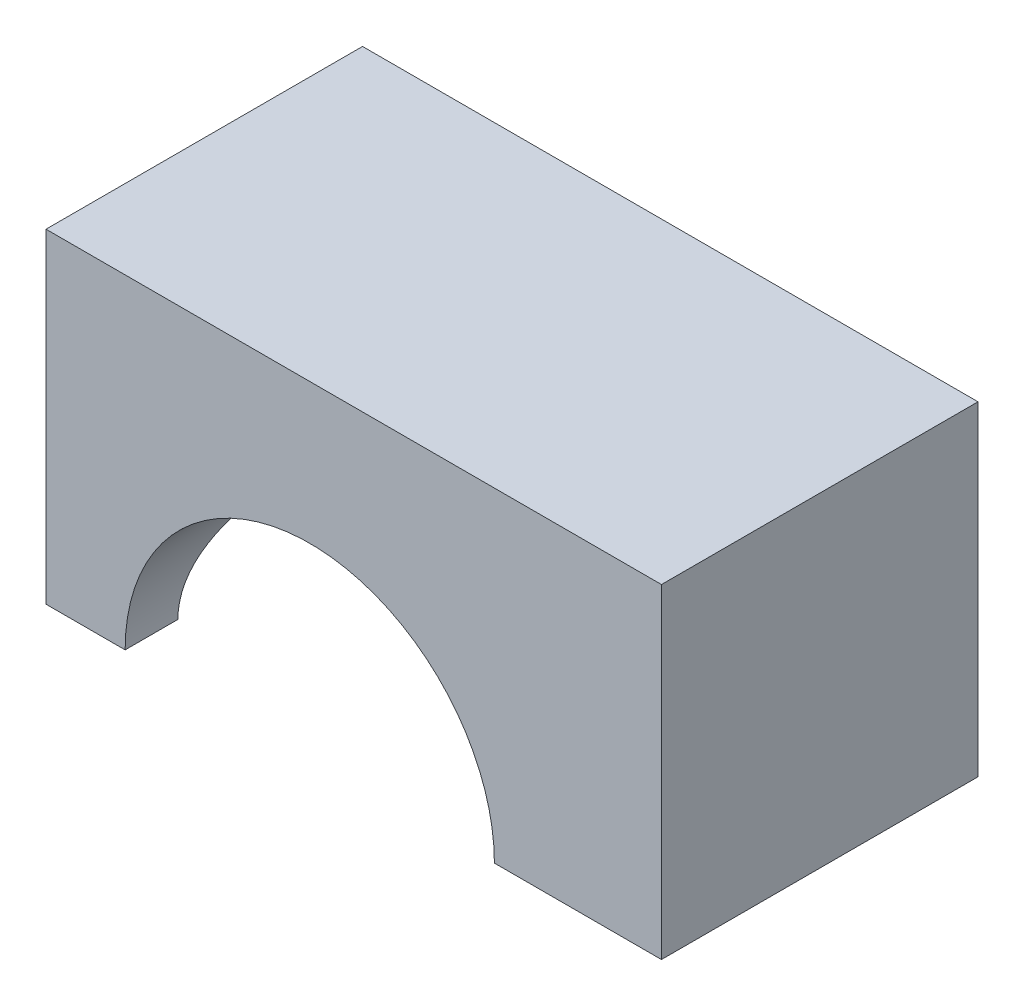
ISO-10303-21;
HEADER;
FILE_DESCRIPTION(('STEP AP214'),'2;1');
FILE_NAME('part.step','',(''),(''),'','','');
FILE_SCHEMA(('AUTOMOTIVE_DESIGN { 1 0 10303 214 1 1 1 1 }'));
ENDSEC;
DATA;
#1=APPLICATION_CONTEXT('core data for automotive mechanical design processes');
#2=APPLICATION_PROTOCOL_DEFINITION('international standard','automotive_design',2000,#1);
#3=PRODUCT_CONTEXT('',#1,'mechanical');
#4=PRODUCT('Part','Part','',(#3));
#5=PRODUCT_RELATED_PRODUCT_CATEGORY('part','',(#4));
#6=PRODUCT_DEFINITION_FORMATION('','',#4);
#7=PRODUCT_DEFINITION_CONTEXT('part definition',#1,'design');
#8=PRODUCT_DEFINITION('design','',#6,#7);
#9=PRODUCT_DEFINITION_SHAPE('','',#8);
#10=(LENGTH_UNIT() NAMED_UNIT(*) SI_UNIT(.MILLI.,.METRE.));
#11=(NAMED_UNIT(*) PLANE_ANGLE_UNIT() SI_UNIT($,.RADIAN.));
#12=(NAMED_UNIT(*) SI_UNIT($,.STERADIAN.) SOLID_ANGLE_UNIT());
#13=UNCERTAINTY_MEASURE_WITH_UNIT(LENGTH_MEASURE(1.E-05),#10,'distance_accuracy_value','');
#14=(GEOMETRIC_REPRESENTATION_CONTEXT(3) GLOBAL_UNCERTAINTY_ASSIGNED_CONTEXT((#13)) GLOBAL_UNIT_ASSIGNED_CONTEXT((#10,
#11,#12)) REPRESENTATION_CONTEXT('',''));
#15=CARTESIAN_POINT('',(0.,0.,0.));
#16=DIRECTION('',(0.,0.,1.));
#17=DIRECTION('',(1.,0.,0.));
#18=AXIS2_PLACEMENT_3D('',#15,#16,#17);
#19=CARTESIAN_POINT('',(0.,0.,0.));
#20=DIRECTION('',(0.,-1.,0.));
#21=DIRECTION('',(0.,0.,-1.));
#22=AXIS2_PLACEMENT_3D('',#19,#20,#21);
#23=PLANE('',#22);
#24=DIRECTION('',(0.,0.,1.));
#25=VECTOR('',#24,1.);
#26=CARTESIAN_POINT('',(-15.,0.,9.));
#27=LINE('',#26,#25);
#28=CARTESIAN_POINT('',(-15.,0.,6.));
#29=VERTEX_POINT('',#28);
#30=CARTESIAN_POINT('',(-15.,0.,9.));
#31=VERTEX_POINT('',#30);
#32=EDGE_CURVE('E111',#29,#31,#27,.T.);
#33=ORIENTED_EDGE('',*,*,#32,.F.);
#34=DIRECTION('',(-1.,0.,0.));
#35=VECTOR('',#34,1.);
#36=CARTESIAN_POINT('',(20.001,0.,6.));
#37=LINE('',#36,#35);
#38=CARTESIAN_POINT('',(-10.5,0.,6.));
#39=VERTEX_POINT('',#38);
#40=EDGE_CURVE('E157',#29,#39,#37,.F.);
#41=ORIENTED_EDGE('',*,*,#40,.T.);
#42=DIRECTION('',(0.,0.,1.));
#43=VECTOR('',#42,1.);
#44=CARTESIAN_POINT('',(-10.5,0.,-9.001));
#45=LINE('',#44,#43);
#46=CARTESIAN_POINT('',(-10.5,0.,9.));
#47=VERTEX_POINT('',#46);
#48=EDGE_CURVE('E149',#39,#47,#45,.T.);
#49=ORIENTED_EDGE('',*,*,#48,.T.);
#50=DIRECTION('',(1.,0.,0.));
#51=VECTOR('',#50,1.);
#52=CARTESIAN_POINT('',(-20.,0.,9.));
#53=LINE('',#52,#51);
#54=EDGE_CURVE('E125',#31,#47,#53,.T.);
#55=ORIENTED_EDGE('',*,*,#54,.F.);
#56=EDGE_LOOP('',(#33,#41,#49,#55));
#57=FACE_BOUND('',#56,.T.);
#58=ADVANCED_FACE('F33',(#57),#23,.T.);
#59=DIRECTION('',(0.,0.,1.));
#60=VECTOR('',#59,1.);
#61=CARTESIAN_POINT('',(10.5,0.,-9.001));
#62=LINE('',#61,#60);
#63=CARTESIAN_POINT('',(10.5,0.,9.));
#64=VERTEX_POINT('',#63);
#65=CARTESIAN_POINT('',(10.5,0.,-9.));
#66=VERTEX_POINT('',#65);
#67=EDGE_CURVE('E144',#64,#66,#62,.F.);
#68=ORIENTED_EDGE('',*,*,#67,.T.);
#69=DIRECTION('',(-1.,0.,0.));
#70=VECTOR('',#69,1.);
#71=CARTESIAN_POINT('',(-20.,0.,-9.));
#72=LINE('',#71,#70);
#73=CARTESIAN_POINT('',(20.,0.,-9.));
#74=VERTEX_POINT('',#73);
#75=EDGE_CURVE('E117',#74,#66,#72,.T.);
#76=ORIENTED_EDGE('',*,*,#75,.F.);
#77=DIRECTION('',(0.,0.,-1.));
#78=VECTOR('',#77,1.);
#79=CARTESIAN_POINT('',(20.,0.,9.));
#80=LINE('',#79,#78);
#81=CARTESIAN_POINT('',(20.,0.,9.));
#82=VERTEX_POINT('',#81);
#83=EDGE_CURVE('E118',#82,#74,#80,.T.);
#84=ORIENTED_EDGE('',*,*,#83,.F.);
#85=EDGE_CURVE('E120',#64,#82,#53,.T.);
#86=ORIENTED_EDGE('',*,*,#85,.F.);
#87=EDGE_LOOP('',(#68,#76,#84,#86));
#88=FACE_BOUND('',#87,.T.);
#89=ADVANCED_FACE('F170',(#88),#23,.T.);
#90=CARTESIAN_POINT('',(20.,18.47,9.));
#91=DIRECTION('',(-1.,0.,0.));
#92=DIRECTION('',(0.,0.,1.));
#93=AXIS2_PLACEMENT_3D('',#90,#91,#92);
#94=PLANE('',#93);
#95=ORIENTED_EDGE('',*,*,#83,.T.);
#96=DIRECTION('',(0.,-1.,0.));
#97=VECTOR('',#96,1.);
#98=CARTESIAN_POINT('',(20.,18.47,-9.));
#99=LINE('',#98,#97);
#100=CARTESIAN_POINT('',(20.,18.47,-9.));
#101=VERTEX_POINT('',#100);
#102=EDGE_CURVE('E11',#101,#74,#99,.T.);
#103=ORIENTED_EDGE('',*,*,#102,.F.);
#104=DIRECTION('',(0.,0.,-1.));
#105=VECTOR('',#104,1.);
#106=CARTESIAN_POINT('',(20.,18.47,9.));
#107=LINE('',#106,#105);
#108=CARTESIAN_POINT('',(20.,18.47,9.));
#109=VERTEX_POINT('',#108);
#110=EDGE_CURVE('E126',#109,#101,#107,.T.);
#111=ORIENTED_EDGE('',*,*,#110,.F.);
#112=DIRECTION('',(0.,-1.,0.));
#113=VECTOR('',#112,1.);
#114=CARTESIAN_POINT('',(20.,18.47,9.));
#115=LINE('',#114,#113);
#116=EDGE_CURVE('E41',#109,#82,#115,.T.);
#117=ORIENTED_EDGE('',*,*,#116,.T.);
#118=EDGE_LOOP('',(#95,#103,#111,#117));
#119=FACE_BOUND('',#118,.T.);
#120=ADVANCED_FACE('F35',(#119),#94,.F.);
#121=CARTESIAN_POINT('',(-20.,18.47,-9.));
#122=DIRECTION('',(0.,0.,1.));
#123=DIRECTION('',(1.,0.,0.));
#124=AXIS2_PLACEMENT_3D('',#121,#122,#123);
#125=PLANE('',#124);
#126=CARTESIAN_POINT('',(-10.5,0.,-9.));
#127=VERTEX_POINT('',#126);
#128=CARTESIAN_POINT('',(-15.,0.,-9.));
#129=VERTEX_POINT('',#128);
#130=EDGE_CURVE('E110',#127,#129,#72,.T.);
#131=ORIENTED_EDGE('',*,*,#130,.T.);
#132=DIRECTION('',(0.,-1.,0.));
#133=VECTOR('',#132,1.);
#134=CARTESIAN_POINT('',(-15.,18.471,-9.));
#135=LINE('',#134,#133);
#136=CARTESIAN_POINT('',(-15.,18.47,-9.));
#137=VERTEX_POINT('',#136);
#138=EDGE_CURVE('E97',#137,#129,#135,.T.);
#139=ORIENTED_EDGE('',*,*,#138,.F.);
#140=DIRECTION('',(-1.,0.,0.));
#141=VECTOR('',#140,1.);
#142=CARTESIAN_POINT('',(-20.,18.47,-9.));
#143=LINE('',#142,#141);
#144=EDGE_CURVE('E133',#101,#137,#143,.T.);
#145=ORIENTED_EDGE('',*,*,#144,.F.);
#146=ORIENTED_EDGE('',*,*,#102,.T.);
#147=ORIENTED_EDGE('',*,*,#75,.T.);
#148=CARTESIAN_POINT('',(0.,0.,-9.));
#149=DIRECTION('',(0.,0.,1.));
#150=DIRECTION('',(1.,0.,0.));
#151=AXIS2_PLACEMENT_3D('',#148,#149,#150);
#152=CIRCLE('',#151,10.5);
#153=EDGE_CURVE('E116',#127,#66,#152,.F.);
#154=ORIENTED_EDGE('',*,*,#153,.F.);
#155=EDGE_LOOP('',(#131,#139,#145,#146,#147,#154));
#156=FACE_BOUND('',#155,.T.);
#157=ADVANCED_FACE('F114',(#156),#125,.F.);
#158=CARTESIAN_POINT('',(-20.,18.47,9.));
#159=DIRECTION('',(0.,0.,-1.));
#160=DIRECTION('',(-1.,0.,0.));
#161=AXIS2_PLACEMENT_3D('',#158,#159,#160);
#162=PLANE('',#161);
#163=DIRECTION('',(1.,0.,0.));
#164=VECTOR('',#163,1.);
#165=CARTESIAN_POINT('',(-20.,18.47,9.));
#166=LINE('',#165,#164);
#167=CARTESIAN_POINT('',(-15.,18.47,9.));
#168=VERTEX_POINT('',#167);
#169=EDGE_CURVE('E128',#168,#109,#166,.T.);
#170=ORIENTED_EDGE('',*,*,#169,.F.);
#171=DIRECTION('',(0.,-1.,0.));
#172=VECTOR('',#171,1.);
#173=CARTESIAN_POINT('',(-15.,18.471,9.));
#174=LINE('',#173,#172);
#175=EDGE_CURVE('E104',#168,#31,#174,.T.);
#176=ORIENTED_EDGE('',*,*,#175,.T.);
#177=ORIENTED_EDGE('',*,*,#54,.T.);
#178=CARTESIAN_POINT('',(0.,0.,9.));
#179=DIRECTION('',(0.,0.,1.));
#180=DIRECTION('',(1.,0.,0.));
#181=AXIS2_PLACEMENT_3D('',#178,#179,#180);
#182=CIRCLE('',#181,10.5);
#183=EDGE_CURVE('E141',#64,#47,#182,.T.);
#184=ORIENTED_EDGE('',*,*,#183,.F.);
#185=ORIENTED_EDGE('',*,*,#85,.T.);
#186=ORIENTED_EDGE('',*,*,#116,.F.);
#187=EDGE_LOOP('',(#170,#176,#177,#184,#185,#186));
#188=FACE_BOUND('',#187,.T.);
#189=ADVANCED_FACE('F187',(#188),#162,.F.);
#190=CARTESIAN_POINT('',(0.,18.47,0.));
#191=DIRECTION('',(0.,-1.,0.));
#192=DIRECTION('',(0.,0.,-1.));
#193=AXIS2_PLACEMENT_3D('',#190,#191,#192);
#194=PLANE('',#193);
#195=ORIENTED_EDGE('',*,*,#144,.T.);
#196=DIRECTION('',(0.,0.,-1.));
#197=VECTOR('',#196,1.);
#198=CARTESIAN_POINT('',(-15.,18.47,9.));
#199=LINE('',#198,#197);
#200=EDGE_CURVE('E100',#168,#137,#199,.T.);
#201=ORIENTED_EDGE('',*,*,#200,.F.);
#202=ORIENTED_EDGE('',*,*,#169,.T.);
#203=ORIENTED_EDGE('',*,*,#110,.T.);
#204=EDGE_LOOP('',(#195,#201,#202,#203));
#205=FACE_BOUND('',#204,.T.);
#206=ADVANCED_FACE('F181',(#205),#194,.F.);
#207=CARTESIAN_POINT('',(-15.,0.,-6.));
#208=VERTEX_POINT('',#207);
#209=EDGE_CURVE('E48',#129,#208,#27,.T.);
#210=ORIENTED_EDGE('',*,*,#209,.F.);
#211=ORIENTED_EDGE('',*,*,#130,.F.);
#212=CARTESIAN_POINT('',(-10.5,0.,-6.));
#213=VERTEX_POINT('',#212);
#214=EDGE_CURVE('E147',#127,#213,#45,.T.);
#215=ORIENTED_EDGE('',*,*,#214,.T.);
#216=DIRECTION('',(-1.,0.,0.));
#217=VECTOR('',#216,1.);
#218=CARTESIAN_POINT('',(20.001,0.,-6.));
#219=LINE('',#218,#217);
#220=EDGE_CURVE('E55',#213,#208,#219,.T.);
#221=ORIENTED_EDGE('',*,*,#220,.T.);
#222=EDGE_LOOP('',(#210,#211,#215,#221));
#223=FACE_BOUND('',#222,.T.);
#224=ADVANCED_FACE('F108',(#223),#23,.T.);
#225=CARTESIAN_POINT('',(0.,0.,-9.001));
#226=DIRECTION('',(0.,0.,1.));
#227=DIRECTION('',(1.,0.,0.));
#228=AXIS2_PLACEMENT_3D('',#225,#226,#227);
#229=CYLINDRICAL_SURFACE('',#228,10.5);
#230=ORIENTED_EDGE('',*,*,#48,.F.);
#231=CARTESIAN_POINT('',(-10.5,0.,-6.));
#232=CARTESIAN_POINT('',(-10.5000312323171,0.155502925143123,-6.00002868326071));
#233=CARTESIAN_POINT('',(-10.4965467619336,0.310989459605455,-5.9939560372494));
#234=CARTESIAN_POINT('',(-10.4827773380282,0.620654508223242,-5.96982428552888));
#235=CARTESIAN_POINT('',(-10.472495621128,0.774833609562622,-5.95177088463915));
#236=CARTESIAN_POINT('',(-10.4454333996789,1.07995629913026,-5.9040190415042));
#237=CARTESIAN_POINT('',(-10.4286872742641,1.23091261863768,-5.87438219231843));
#238=CARTESIAN_POINT('',(-10.3891154411449,1.52935731424097,-5.80384155522881));
#239=CARTESIAN_POINT('',(-10.3662892642791,1.67684542175931,-5.76293689784672));
#240=CARTESIAN_POINT('',(-10.3151366966868,1.96713870302777,-5.67040818495836));
#241=CARTESIAN_POINT('',(-10.2868201926486,2.10995176296317,-5.6188033862729));
#242=CARTESIAN_POINT('',(-10.2252973118242,2.39038550341413,-5.50535790834433));
#243=CARTESIAN_POINT('',(-10.1920890817453,2.5280041910418,-5.44351334853124));
#244=CARTESIAN_POINT('',(-10.0861193920345,2.93216830627208,-5.24334940394797));
#245=CARTESIAN_POINT('',(-10.0070202984068,3.1899816733811,-5.09041269971699));
#246=CARTESIAN_POINT('',(-9.83222574184396,3.69512383646307,-4.73790322568543));
#247=CARTESIAN_POINT('',(-9.7357476069095,3.94038133658734,-4.53577592438749));
#248=CARTESIAN_POINT('',(-9.53892202787594,4.39551157162937,-4.09630897576221));
#249=CARTESIAN_POINT('',(-9.43857081219306,4.60534868869554,-3.85893433002525));
#250=CARTESIAN_POINT('',(-9.23241829705254,5.00686738849591,-3.32482825851804));
#251=CARTESIAN_POINT('',(-9.1272116275037,5.19409089283758,-3.02444886551071));
#252=CARTESIAN_POINT('',(-8.98479353337835,5.43435387829326,-2.54937929896771));
#253=CARTESIAN_POINT('',(-8.93989050301715,5.50767329511113,-2.38695977929524));
#254=CARTESIAN_POINT('',(-8.85696777871921,5.64005451406595,-2.05468008989987));
#255=CARTESIAN_POINT('',(-8.81894582704675,5.69912099483071,-1.88482238350506));
#256=CARTESIAN_POINT('',(-8.75900479298559,5.79069350293105,-1.57722146865764));
#257=CARTESIAN_POINT('',(-8.73538420623737,5.82618464662098,-1.44068900951035));
#258=CARTESIAN_POINT('',(-8.69411873649479,5.88758618847257,-1.16460806153307));
#259=CARTESIAN_POINT('',(-8.67647258151584,5.91349862609376,-1.02506022143096));
#260=CARTESIAN_POINT('',(-8.64776851771148,5.95539645016538,-0.743930927036742));
#261=CARTESIAN_POINT('',(-8.63670492774402,5.97139039736415,-0.602351334677315));
#262=CARTESIAN_POINT('',(-8.62154261003826,5.99326137071358,-0.318033404753159));
#263=CARTESIAN_POINT('',(-8.61744402127387,5.99913819499552,-0.175295044124418));
#264=CARTESIAN_POINT('',(-8.61636587961779,6.00068664959584,0.110458829006182));
#265=CARTESIAN_POINT('',(-8.61939601081516,5.99634439769363,0.253474454509471));
#266=CARTESIAN_POINT('',(-8.63248014050462,5.97749246711862,0.538504544520632));
#267=CARTESIAN_POINT('',(-8.64253416674081,5.96298274828477,0.680519005071708));
#268=CARTESIAN_POINT('',(-8.66930589933352,5.92399304566501,0.962589777827786));
#269=CARTESIAN_POINT('',(-8.68602610500563,5.89950932230301,1.10264533518271));
#270=CARTESIAN_POINT('',(-8.72554694173816,5.84089629409534,1.37986871062944));
#271=CARTESIAN_POINT('',(-8.74835002778777,5.80676309448519,1.51703533860869));
#272=CARTESIAN_POINT('',(-8.82460229177655,5.69078084989655,1.92183102381229));
#273=CARTESIAN_POINT('',(-8.88603904603347,5.59515083407102,2.184154118654));
#274=CARTESIAN_POINT('',(-9.02357537045335,5.37050972239288,2.6896830519722));
#275=CARTESIAN_POINT('',(-9.09968079043222,5.24148530189929,2.93288120882267));
#276=CARTESIAN_POINT('',(-9.27278901621917,4.92970041368248,3.43491779845721));
#277=CARTESIAN_POINT('',(-9.37118647785558,4.74164295800828,3.69002155625297));
#278=CARTESIAN_POINT('',(-9.51963407244217,4.43167932701314,4.04786482987679));
#279=CARTESIAN_POINT('',(-9.569298391235,4.3236146907551,4.16309237053519));
#280=CARTESIAN_POINT('',(-9.66784979801288,4.09850674859315,4.38488226998758));
#281=CARTESIAN_POINT('',(-9.71673675848215,3.98146198758747,4.49144321869622));
#282=CARTESIAN_POINT('',(-9.81815731565572,3.72490802201013,4.70704547522145));
#283=CARTESIAN_POINT('',(-9.87046404907576,3.58436314547206,4.81496363613988));
#284=CARTESIAN_POINT('',(-9.97131462894593,3.29341403182272,5.01845800180585));
#285=CARTESIAN_POINT('',(-10.0198599947089,3.14301382132218,5.11403920026658));
#286=CARTESIAN_POINT('',(-10.111798359052,2.83330042558111,5.29190468197646));
#287=CARTESIAN_POINT('',(-10.1551977262947,2.67399862404779,5.37420544755071));
#288=CARTESIAN_POINT('',(-10.2356204791023,2.34740884183261,5.52466913121936));
#289=CARTESIAN_POINT('',(-10.272647735488,2.18012578891822,5.59284063749481));
#290=CARTESIAN_POINT('',(-10.3368535242973,1.85083055260308,5.70988272169392));
#291=CARTESIAN_POINT('',(-10.364543416916,1.68928242275379,5.75977740504482));
#292=CARTESIAN_POINT('',(-10.4126648623234,1.36155617090495,5.84592739375965));
#293=CARTESIAN_POINT('',(-10.433097691071,1.19537886836698,5.88218509688455));
#294=CARTESIAN_POINT('',(-10.4662149385246,0.85857650246765,5.94072776248758));
#295=CARTESIAN_POINT('',(-10.4788444595665,0.687928538185176,5.96291375628162));
#296=CARTESIAN_POINT('',(-10.4915160033629,0.430685549197037,5.98514324040381));
#297=CARTESIAN_POINT('',(-10.4946944134647,0.344680981066985,5.99071150065149));
#298=CARTESIAN_POINT('',(-10.4989372292922,0.172455798337681,5.99814038563698));
#299=CARTESIAN_POINT('',(-10.5000015336611,0.0862351735784179,6.00000083261077));
#300=CARTESIAN_POINT('',(-10.5,0.,6.));
#301=B_SPLINE_CURVE_WITH_KNOTS('',3,(#231,#232,#233,#234,#235,#236,#237,#238,#239,#240,#241,
#242,#243,#244,#245,#246,#247,#248,#249,#250,#251,#252,#253,#254,#255,#256,#257,#258,#259,#260,
#261,#262,#263,#264,#265,#266,#267,#268,#269,#270,#271,#272,#273,#274,#275,#276,#277,#278,#279,
#280,#281,#282,#283,#284,#285,#286,#287,#288,#289,#290,#291,#292,#293,#294,#295,#296,#297,#298,
#299,#300),.UNSPECIFIED.,.F.,.F.,(4,2,2,2,2,2,2,2,2,2,2,2,2,2,2,2,2,2,2,2,2,2,2,2,2,2,2,2,2,2,2,
2,2,2,4),(0.,0.466325450821407,0.932429012825639,1.39608714609375,1.85978106747844,
2.32264762110014,2.78568999079645,3.71190164616867,4.70440865553539,5.69790783519077,
6.79948138478367,7.35013944891105,7.90061650895936,8.32928412961428,8.75786042744241,
9.18606630005451,9.61428071663408,10.0430771816857,10.4718753404744,10.9008344177125,
11.3299668811251,12.1840218241832,13.0384180689222,14.0296721281382,14.526090368468,
15.0225892169002,15.5761655870355,16.1295171749984,16.6821766273884,17.2344991654586,
17.7477562391189,18.260923025654,18.7776601070629,19.0362978380061,19.2949479685426),.UNSPECIFIED.);
#302=EDGE_CURVE('E150',#213,#39,#301,.T.);
#303=ORIENTED_EDGE('',*,*,#302,.F.);
#304=ORIENTED_EDGE('',*,*,#214,.F.);
#305=ORIENTED_EDGE('',*,*,#153,.T.);
#306=ORIENTED_EDGE('',*,*,#67,.F.);
#307=ORIENTED_EDGE('',*,*,#183,.T.);
#308=EDGE_LOOP('',(#230,#303,#304,#305,#306,#307));
#309=FACE_BOUND('',#308,.T.);
#310=ADVANCED_FACE('F168',(#309),#229,.F.);
#311=CARTESIAN_POINT('',(20.001,0.,0.));
#312=DIRECTION('',(-1.,0.,0.));
#313=DIRECTION('',(0.,0.,1.));
#314=AXIS2_PLACEMENT_3D('',#311,#312,#313);
#315=CYLINDRICAL_SURFACE('',#314,6.);
#316=ORIENTED_EDGE('',*,*,#40,.F.);
#317=CARTESIAN_POINT('',(-15.,0.,0.));
#318=DIRECTION('',(1.,0.,0.));
#319=DIRECTION('',(0.,0.,-1.));
#320=AXIS2_PLACEMENT_3D('',#317,#318,#319);
#321=CIRCLE('',#320,6.);
#322=EDGE_CURVE('E200',#208,#29,#321,.T.);
#323=ORIENTED_EDGE('',*,*,#322,.F.);
#324=ORIENTED_EDGE('',*,*,#220,.F.);
#325=ORIENTED_EDGE('',*,*,#302,.T.);
#326=EDGE_LOOP('',(#316,#323,#324,#325));
#327=FACE_BOUND('',#326,.T.);
#328=ADVANCED_FACE('F159',(#327),#315,.F.);
#329=CARTESIAN_POINT('',(-15.,18.471,9.));
#330=DIRECTION('',(1.,0.,0.));
#331=DIRECTION('',(0.,0.,-1.));
#332=AXIS2_PLACEMENT_3D('',#329,#330,#331);
#333=PLANE('',#332);
#334=ORIENTED_EDGE('',*,*,#200,.T.);
#335=ORIENTED_EDGE('',*,*,#138,.T.);
#336=ORIENTED_EDGE('',*,*,#209,.T.);
#337=ORIENTED_EDGE('',*,*,#322,.T.);
#338=ORIENTED_EDGE('',*,*,#32,.T.);
#339=ORIENTED_EDGE('',*,*,#175,.F.);
#340=EDGE_LOOP('',(#334,#335,#336,#337,#338,#339));
#341=FACE_BOUND('',#340,.T.);
#342=ADVANCED_FACE('F98',(#341),#333,.F.);
#343=CLOSED_SHELL('',(#58,#89,#120,#157,#189,#206,#224,#310,#328,#342));
#344=MANIFOLD_SOLID_BREP('B2',#343);
#345=ADVANCED_BREP_SHAPE_REPRESENTATION('',(#18,#344),#14);
#346=SHAPE_DEFINITION_REPRESENTATION(#9,#345);
ENDSEC;
END-ISO-10303-21;
